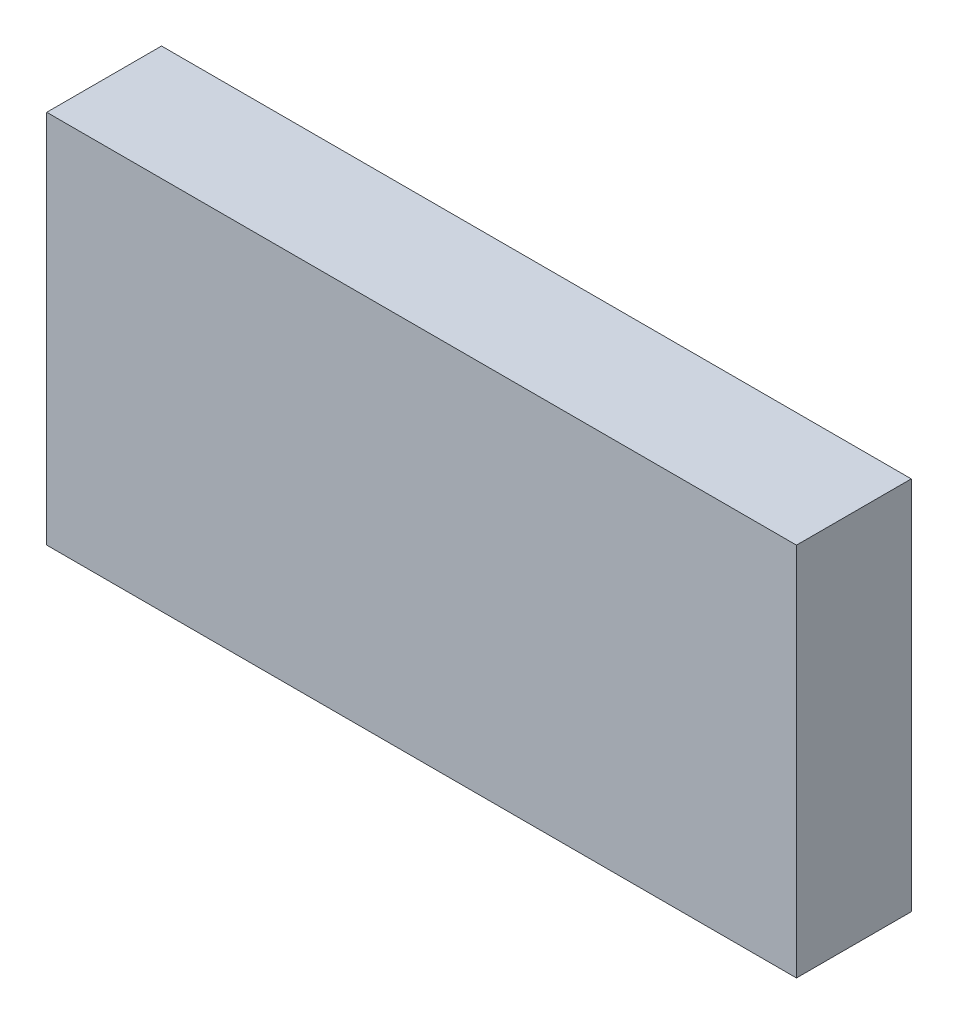
ISO-10303-21;
HEADER;
FILE_DESCRIPTION(('STEP AP214'),'2;1');
FILE_NAME('part.step','',(''),(''),'','','');
FILE_SCHEMA(('AUTOMOTIVE_DESIGN { 1 0 10303 214 1 1 1 1 }'));
ENDSEC;
DATA;
#1=APPLICATION_CONTEXT('core data for automotive mechanical design processes');
#2=APPLICATION_PROTOCOL_DEFINITION('international standard','automotive_design',2000,#1);
#3=PRODUCT_CONTEXT('',#1,'mechanical');
#4=PRODUCT('Part','Part','',(#3));
#5=PRODUCT_RELATED_PRODUCT_CATEGORY('part','',(#4));
#6=PRODUCT_DEFINITION_FORMATION('','',#4);
#7=PRODUCT_DEFINITION_CONTEXT('part definition',#1,'design');
#8=PRODUCT_DEFINITION('design','',#6,#7);
#9=PRODUCT_DEFINITION_SHAPE('','',#8);
#10=(LENGTH_UNIT() NAMED_UNIT(*) SI_UNIT(.MILLI.,.METRE.));
#11=(NAMED_UNIT(*) PLANE_ANGLE_UNIT() SI_UNIT($,.RADIAN.));
#12=(NAMED_UNIT(*) SI_UNIT($,.STERADIAN.) SOLID_ANGLE_UNIT());
#13=UNCERTAINTY_MEASURE_WITH_UNIT(LENGTH_MEASURE(1.E-05),#10,'distance_accuracy_value','');
#14=(GEOMETRIC_REPRESENTATION_CONTEXT(3) GLOBAL_UNCERTAINTY_ASSIGNED_CONTEXT((#13)) GLOBAL_UNIT_ASSIGNED_CONTEXT((#10,
#11,#12)) REPRESENTATION_CONTEXT('',''));
#15=CARTESIAN_POINT('',(0.,0.,0.));
#16=DIRECTION('',(0.,0.,1.));
#17=DIRECTION('',(1.,0.,0.));
#18=AXIS2_PLACEMENT_3D('',#15,#16,#17);
#19=CARTESIAN_POINT('',(-1.6002,-0.8001,0.49));
#20=DIRECTION('',(0.,0.,1.));
#21=DIRECTION('',(1.,0.,0.));
#22=AXIS2_PLACEMENT_3D('',#19,#20,#21);
#23=PLANE('',#22);
#24=DIRECTION('',(1.,0.,0.));
#25=VECTOR('',#24,1.);
#26=CARTESIAN_POINT('',(-1.6002,0.8001,0.49));
#27=LINE('',#26,#25);
#28=CARTESIAN_POINT('',(-1.6002,0.8001,0.49));
#29=VERTEX_POINT('',#28);
#30=CARTESIAN_POINT('',(1.6002,0.8001,0.49));
#31=VERTEX_POINT('',#30);
#32=EDGE_CURVE('E53',#29,#31,#27,.T.);
#33=ORIENTED_EDGE('',*,*,#32,.F.);
#34=DIRECTION('',(0.,1.,0.));
#35=VECTOR('',#34,1.);
#36=CARTESIAN_POINT('',(-1.6002,-0.8001,0.49));
#37=LINE('',#36,#35);
#38=CARTESIAN_POINT('',(-1.6002,-0.8001,0.49));
#39=VERTEX_POINT('',#38);
#40=EDGE_CURVE('E20',#29,#39,#37,.F.);
#41=ORIENTED_EDGE('',*,*,#40,.T.);
#42=DIRECTION('',(1.,0.,0.));
#43=VECTOR('',#42,1.);
#44=CARTESIAN_POINT('',(1.6002,-0.8001,0.49));
#45=LINE('',#44,#43);
#46=CARTESIAN_POINT('',(1.6002,-0.8001,0.49));
#47=VERTEX_POINT('',#46);
#48=EDGE_CURVE('E67',#47,#39,#45,.F.);
#49=ORIENTED_EDGE('',*,*,#48,.F.);
#50=DIRECTION('',(0.,1.,0.));
#51=VECTOR('',#50,1.);
#52=CARTESIAN_POINT('',(1.6002,0.8001,0.49));
#53=LINE('',#52,#51);
#54=EDGE_CURVE('E58',#31,#47,#53,.F.);
#55=ORIENTED_EDGE('',*,*,#54,.F.);
#56=EDGE_LOOP('',(#33,#41,#49,#55));
#57=FACE_BOUND('',#56,.T.);
#58=ADVANCED_FACE('F17',(#57),#23,.T.);
#59=CARTESIAN_POINT('',(1.6002,-0.8001,0.));
#60=DIRECTION('',(0.,-1.,0.));
#61=DIRECTION('',(0.,0.,-1.));
#62=AXIS2_PLACEMENT_3D('',#59,#60,#61);
#63=PLANE('',#62);
#64=DIRECTION('',(0.,0.,1.));
#65=VECTOR('',#64,1.);
#66=CARTESIAN_POINT('',(-1.6002,-0.8001,0.));
#67=LINE('',#66,#65);
#68=CARTESIAN_POINT('',(-1.6002,-0.8001,0.));
#69=VERTEX_POINT('',#68);
#70=EDGE_CURVE('E80',#69,#39,#67,.T.);
#71=ORIENTED_EDGE('',*,*,#70,.F.);
#72=DIRECTION('',(1.,0.,0.));
#73=VECTOR('',#72,1.);
#74=CARTESIAN_POINT('',(-1.6002,-0.8001,0.));
#75=LINE('',#74,#73);
#76=CARTESIAN_POINT('',(1.6002,-0.8001,0.));
#77=VERTEX_POINT('',#76);
#78=EDGE_CURVE('E75',#69,#77,#75,.T.);
#79=ORIENTED_EDGE('',*,*,#78,.T.);
#80=DIRECTION('',(0.,0.,-1.));
#81=VECTOR('',#80,1.);
#82=CARTESIAN_POINT('',(1.6002,-0.8001,0.));
#83=LINE('',#82,#81);
#84=EDGE_CURVE('E63',#47,#77,#83,.T.);
#85=ORIENTED_EDGE('',*,*,#84,.F.);
#86=ORIENTED_EDGE('',*,*,#48,.T.);
#87=EDGE_LOOP('',(#71,#79,#85,#86));
#88=FACE_BOUND('',#87,.T.);
#89=ADVANCED_FACE('F74',(#88),#63,.T.);
#90=CARTESIAN_POINT('',(1.6002,0.8001,0.));
#91=DIRECTION('',(1.,0.,0.));
#92=DIRECTION('',(0.,0.,-1.));
#93=AXIS2_PLACEMENT_3D('',#90,#91,#92);
#94=PLANE('',#93);
#95=ORIENTED_EDGE('',*,*,#84,.T.);
#96=DIRECTION('',(0.,1.,0.));
#97=VECTOR('',#96,1.);
#98=CARTESIAN_POINT('',(1.6002,-0.8001,0.));
#99=LINE('',#98,#97);
#100=CARTESIAN_POINT('',(1.6002,0.8001,0.));
#101=VERTEX_POINT('',#100);
#102=EDGE_CURVE('E84',#77,#101,#99,.T.);
#103=ORIENTED_EDGE('',*,*,#102,.T.);
#104=DIRECTION('',(0.,0.,1.));
#105=VECTOR('',#104,1.);
#106=CARTESIAN_POINT('',(1.6002,0.8001,0.));
#107=LINE('',#106,#105);
#108=EDGE_CURVE('E65',#31,#101,#107,.F.);
#109=ORIENTED_EDGE('',*,*,#108,.F.);
#110=ORIENTED_EDGE('',*,*,#54,.T.);
#111=EDGE_LOOP('',(#95,#103,#109,#110));
#112=FACE_BOUND('',#111,.T.);
#113=ADVANCED_FACE('F60',(#112),#94,.T.);
#114=CARTESIAN_POINT('',(-1.6002,0.8001,0.));
#115=DIRECTION('',(0.,1.,0.));
#116=DIRECTION('',(0.,0.,1.));
#117=AXIS2_PLACEMENT_3D('',#114,#115,#116);
#118=PLANE('',#117);
#119=ORIENTED_EDGE('',*,*,#108,.T.);
#120=DIRECTION('',(1.,0.,0.));
#121=VECTOR('',#120,1.);
#122=CARTESIAN_POINT('',(-1.6002,0.8001,0.));
#123=LINE('',#122,#121);
#124=CARTESIAN_POINT('',(-1.6002,0.8001,0.));
#125=VERTEX_POINT('',#124);
#126=EDGE_CURVE('E26',#101,#125,#123,.F.);
#127=ORIENTED_EDGE('',*,*,#126,.T.);
#128=DIRECTION('',(0.,0.,1.));
#129=VECTOR('',#128,1.);
#130=CARTESIAN_POINT('',(-1.6002,0.8001,0.));
#131=LINE('',#130,#129);
#132=EDGE_CURVE('E34',#29,#125,#131,.F.);
#133=ORIENTED_EDGE('',*,*,#132,.F.);
#134=ORIENTED_EDGE('',*,*,#32,.T.);
#135=EDGE_LOOP('',(#119,#127,#133,#134));
#136=FACE_BOUND('',#135,.T.);
#137=ADVANCED_FACE('F88',(#136),#118,.T.);
#138=CARTESIAN_POINT('',(-1.6002,-0.8001,0.));
#139=DIRECTION('',(-1.,0.,0.));
#140=DIRECTION('',(0.,0.,1.));
#141=AXIS2_PLACEMENT_3D('',#138,#139,#140);
#142=PLANE('',#141);
#143=ORIENTED_EDGE('',*,*,#132,.T.);
#144=DIRECTION('',(0.,1.,0.));
#145=VECTOR('',#144,1.);
#146=CARTESIAN_POINT('',(-1.6002,-0.8001,0.));
#147=LINE('',#146,#145);
#148=EDGE_CURVE('E11',#125,#69,#147,.F.);
#149=ORIENTED_EDGE('',*,*,#148,.T.);
#150=ORIENTED_EDGE('',*,*,#70,.T.);
#151=ORIENTED_EDGE('',*,*,#40,.F.);
#152=EDGE_LOOP('',(#143,#149,#150,#151));
#153=FACE_BOUND('',#152,.T.);
#154=ADVANCED_FACE('F91',(#153),#142,.T.);
#155=CARTESIAN_POINT('',(-1.6002,-0.8001,0.));
#156=DIRECTION('',(0.,0.,1.));
#157=DIRECTION('',(1.,0.,0.));
#158=AXIS2_PLACEMENT_3D('',#155,#156,#157);
#159=PLANE('',#158);
#160=ORIENTED_EDGE('',*,*,#126,.F.);
#161=ORIENTED_EDGE('',*,*,#102,.F.);
#162=ORIENTED_EDGE('',*,*,#78,.F.);
#163=ORIENTED_EDGE('',*,*,#148,.F.);
#164=EDGE_LOOP('',(#160,#161,#162,#163));
#165=FACE_BOUND('',#164,.T.);
#166=ADVANCED_FACE('F90',(#165),#159,.F.);
#167=CLOSED_SHELL('',(#58,#89,#113,#137,#154,#166));
#168=MANIFOLD_SOLID_BREP('B1',#167);
#169=ADVANCED_BREP_SHAPE_REPRESENTATION('',(#18,#168),#14);
#170=SHAPE_DEFINITION_REPRESENTATION(#9,#169);
ENDSEC;
END-ISO-10303-21;
